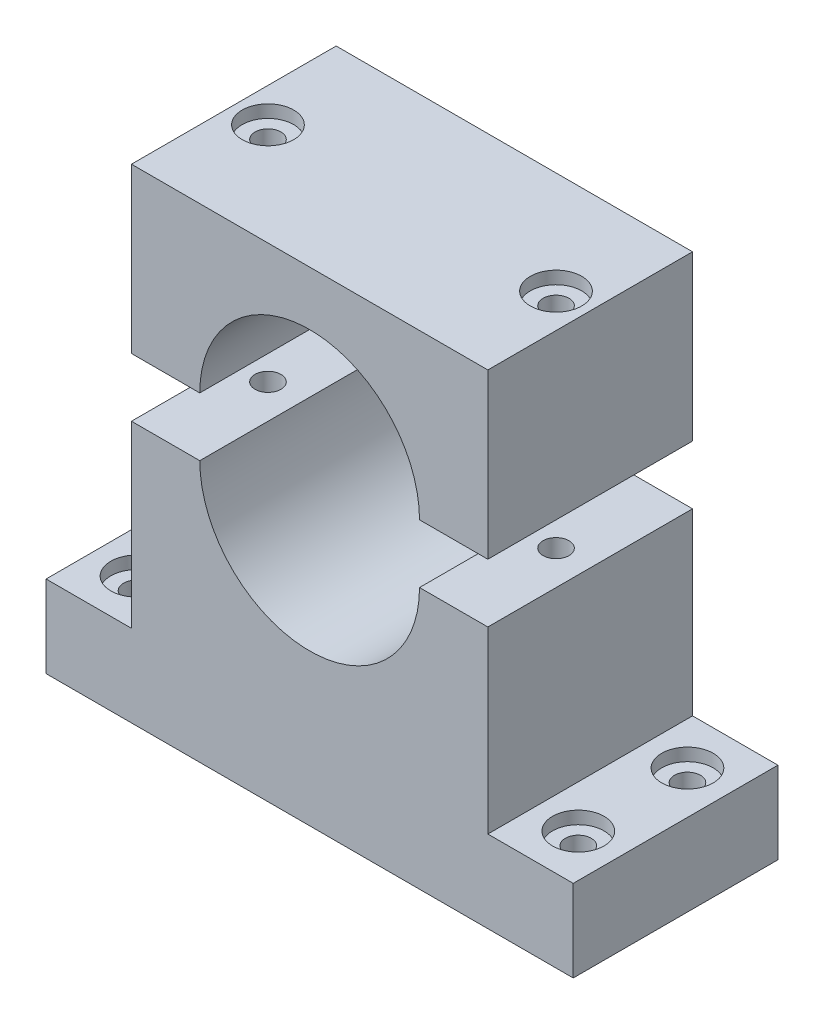
ISO-10303-21;
HEADER;
FILE_DESCRIPTION(('STEP AP214'),'2;1');
FILE_NAME('part.step','',(''),(''),'','','');
FILE_SCHEMA(('AUTOMOTIVE_DESIGN { 1 0 10303 214 1 1 1 1 }'));
ENDSEC;
DATA;
#1=APPLICATION_CONTEXT('core data for automotive mechanical design processes');
#2=APPLICATION_PROTOCOL_DEFINITION('international standard','automotive_design',2000,#1);
#3=PRODUCT_CONTEXT('',#1,'mechanical');
#4=PRODUCT('Part','Part','',(#3));
#5=PRODUCT_RELATED_PRODUCT_CATEGORY('part','',(#4));
#6=PRODUCT_DEFINITION_FORMATION('','',#4);
#7=PRODUCT_DEFINITION_CONTEXT('part definition',#1,'design');
#8=PRODUCT_DEFINITION('design','',#6,#7);
#9=PRODUCT_DEFINITION_SHAPE('','',#8);
#10=(LENGTH_UNIT() NAMED_UNIT(*) SI_UNIT(.MILLI.,.METRE.));
#11=(NAMED_UNIT(*) PLANE_ANGLE_UNIT() SI_UNIT($,.RADIAN.));
#12=(NAMED_UNIT(*) SI_UNIT($,.STERADIAN.) SOLID_ANGLE_UNIT());
#13=UNCERTAINTY_MEASURE_WITH_UNIT(LENGTH_MEASURE(1.E-05),#10,'distance_accuracy_value','');
#14=(GEOMETRIC_REPRESENTATION_CONTEXT(3) GLOBAL_UNCERTAINTY_ASSIGNED_CONTEXT((#13)) GLOBAL_UNIT_ASSIGNED_CONTEXT((#10,
#11,#12)) REPRESENTATION_CONTEXT('',''));
#15=CARTESIAN_POINT('',(0.,0.,0.));
#16=DIRECTION('',(0.,0.,1.));
#17=DIRECTION('',(1.,0.,0.));
#18=AXIS2_PLACEMENT_3D('',#15,#16,#17);
#19=CARTESIAN_POINT('',(16.1027237355266,8.59368157906341,30.));
#20=DIRECTION('',(0.,0.,-1.));
#21=DIRECTION('',(-1.,0.,0.));
#22=AXIS2_PLACEMENT_3D('',#19,#20,#21);
#23=CYLINDRICAL_SURFACE('',#22,16.1027237355266);
#24=CARTESIAN_POINT('',(16.1027237355266,8.59368157906341,0.));
#25=DIRECTION('',(0.,0.,-1.));
#26=DIRECTION('',(-1.,0.,0.));
#27=AXIS2_PLACEMENT_3D('',#24,#25,#26);
#28=CIRCLE('',#27,16.1027237355266);
#29=CARTESIAN_POINT('',(0.,8.59368157906341,0.));
#30=VERTEX_POINT('',#29);
#31=CARTESIAN_POINT('',(32.2054474710532,8.59368157906341,0.));
#32=VERTEX_POINT('',#31);
#33=EDGE_CURVE('E133',#30,#32,#28,.T.);
#34=ORIENTED_EDGE('',*,*,#33,.T.);
#35=DIRECTION('',(0.,0.,-1.));
#36=VECTOR('',#35,1.);
#37=CARTESIAN_POINT('',(32.2054474710532,8.59368157906341,30.));
#38=LINE('',#37,#36);
#39=CARTESIAN_POINT('',(32.2054474710532,8.59368157906341,30.));
#40=VERTEX_POINT('',#39);
#41=EDGE_CURVE('E12',#40,#32,#38,.T.);
#42=ORIENTED_EDGE('',*,*,#41,.F.);
#43=CARTESIAN_POINT('',(16.1027237355266,8.59368157906341,30.));
#44=DIRECTION('',(0.,0.,-1.));
#45=DIRECTION('',(-1.,0.,0.));
#46=AXIS2_PLACEMENT_3D('',#43,#44,#45);
#47=CIRCLE('',#46,16.1027237355266);
#48=CARTESIAN_POINT('',(0.,8.59368157906341,30.));
#49=VERTEX_POINT('',#48);
#50=EDGE_CURVE('E144',#49,#40,#47,.T.);
#51=ORIENTED_EDGE('',*,*,#50,.F.);
#52=DIRECTION('',(0.,0.,-1.));
#53=VECTOR('',#52,1.);
#54=CARTESIAN_POINT('',(0.,8.59368157906341,30.));
#55=LINE('',#54,#53);
#56=EDGE_CURVE('E129',#49,#30,#55,.T.);
#57=ORIENTED_EDGE('',*,*,#56,.T.);
#58=EDGE_LOOP('',(#34,#42,#51,#57));
#59=FACE_BOUND('',#58,.T.);
#60=ADVANCED_FACE('F47',(#59),#23,.F.);
#61=CARTESIAN_POINT('',(42.2175036796708,8.59368157906341,30.));
#62=DIRECTION('',(0.,1.,0.));
#63=DIRECTION('',(-1.,0.,0.));
#64=AXIS2_PLACEMENT_3D('',#61,#62,#63);
#65=PLANE('',#64);
#66=CARTESIAN_POINT('',(37.211475575362,8.59368157906341,15.));
#67=DIRECTION('',(0.,1.,0.));
#68=DIRECTION('',(-1.,0.,0.));
#69=AXIS2_PLACEMENT_3D('',#66,#67,#68);
#70=CIRCLE('',#69,1.89864999999999);
#71=CARTESIAN_POINT('',(35.312825575362,8.59368157906341,15.));
#72=VERTEX_POINT('',#71);
#73=EDGE_CURVE('E137',#72,#72,#70,.T.);
#74=ORIENTED_EDGE('',*,*,#73,.T.);
#75=EDGE_LOOP('',(#74));
#76=FACE_BOUND('',#75,.T.);
#77=DIRECTION('',(1.,0.,0.));
#78=VECTOR('',#77,1.);
#79=CARTESIAN_POINT('',(42.2175036796708,8.59368157906341,0.));
#80=LINE('',#79,#78);
#81=CARTESIAN_POINT('',(42.2175036796708,8.59368157906341,0.));
#82=VERTEX_POINT('',#81);
#83=EDGE_CURVE('E136',#32,#82,#80,.T.);
#84=ORIENTED_EDGE('',*,*,#83,.T.);
#85=DIRECTION('',(0.,0.,-1.));
#86=VECTOR('',#85,1.);
#87=CARTESIAN_POINT('',(42.2175036796708,8.59368157906341,30.));
#88=LINE('',#87,#86);
#89=CARTESIAN_POINT('',(42.2175036796708,8.59368157906341,30.));
#90=VERTEX_POINT('',#89);
#91=EDGE_CURVE('E56',#90,#82,#88,.T.);
#92=ORIENTED_EDGE('',*,*,#91,.F.);
#93=DIRECTION('',(1.,0.,0.));
#94=VECTOR('',#93,1.);
#95=CARTESIAN_POINT('',(42.2175036796708,8.59368157906341,30.));
#96=LINE('',#95,#94);
#97=EDGE_CURVE('E102',#40,#90,#96,.T.);
#98=ORIENTED_EDGE('',*,*,#97,.F.);
#99=ORIENTED_EDGE('',*,*,#41,.T.);
#100=EDGE_LOOP('',(#84,#92,#98,#99));
#101=FACE_BOUND('',#100,.T.);
#102=ADVANCED_FACE('F166',(#76,#101),#65,.F.);
#103=CARTESIAN_POINT('',(42.2175036796708,32.6226164797456,30.));
#104=DIRECTION('',(-1.,0.,0.));
#105=DIRECTION('',(0.,0.,1.));
#106=AXIS2_PLACEMENT_3D('',#103,#104,#105);
#107=PLANE('',#106);
#108=DIRECTION('',(0.,1.,0.));
#109=VECTOR('',#108,1.);
#110=CARTESIAN_POINT('',(42.2175036796708,32.6226164797456,0.));
#111=LINE('',#110,#109);
#112=CARTESIAN_POINT('',(42.2175036796708,32.6226164797456,0.));
#113=VERTEX_POINT('',#112);
#114=EDGE_CURVE('E139',#82,#113,#111,.T.);
#115=ORIENTED_EDGE('',*,*,#114,.T.);
#116=DIRECTION('',(0.,0.,-1.));
#117=VECTOR('',#116,1.);
#118=CARTESIAN_POINT('',(42.2175036796708,32.6226164797456,30.));
#119=LINE('',#118,#117);
#120=CARTESIAN_POINT('',(42.2175036796708,32.6226164797456,30.));
#121=VERTEX_POINT('',#120);
#122=EDGE_CURVE('E124',#121,#113,#119,.T.);
#123=ORIENTED_EDGE('',*,*,#122,.F.);
#124=DIRECTION('',(0.,1.,0.));
#125=VECTOR('',#124,1.);
#126=CARTESIAN_POINT('',(42.2175036796708,32.6226164797456,30.));
#127=LINE('',#126,#125);
#128=EDGE_CURVE('E115',#90,#121,#127,.T.);
#129=ORIENTED_EDGE('',*,*,#128,.F.);
#130=ORIENTED_EDGE('',*,*,#91,.T.);
#131=EDGE_LOOP('',(#115,#123,#129,#130));
#132=FACE_BOUND('',#131,.T.);
#133=ADVANCED_FACE('F169',(#132),#107,.F.);
#134=CARTESIAN_POINT('',(-10.0120562086176,32.6226164797456,30.));
#135=DIRECTION('',(0.,-1.,0.));
#136=DIRECTION('',(0.,0.,-1.));
#137=AXIS2_PLACEMENT_3D('',#134,#135,#136);
#138=PLANE('',#137);
#139=CARTESIAN_POINT('',(-5.00602810430879,32.6226164797456,15.));
#140=DIRECTION('',(0.,1.,0.));
#141=DIRECTION('',(0.,0.,1.));
#142=AXIS2_PLACEMENT_3D('',#139,#140,#141);
#143=CIRCLE('',#142,3.77063);
#144=CARTESIAN_POINT('',(-5.00602810430879,32.6226164797456,18.77063));
#145=VERTEX_POINT('',#144);
#146=EDGE_CURVE('E202',#145,#145,#143,.T.);
#147=ORIENTED_EDGE('',*,*,#146,.F.);
#148=EDGE_LOOP('',(#147));
#149=FACE_BOUND('',#148,.T.);
#150=CARTESIAN_POINT('',(37.211475575362,32.6226164797456,15.));
#151=DIRECTION('',(0.,1.,0.));
#152=DIRECTION('',(0.,0.,1.));
#153=AXIS2_PLACEMENT_3D('',#150,#151,#152);
#154=CIRCLE('',#153,3.77063);
#155=CARTESIAN_POINT('',(37.211475575362,32.6226164797456,18.77063));
#156=VERTEX_POINT('',#155);
#157=EDGE_CURVE('E159',#156,#156,#154,.T.);
#158=ORIENTED_EDGE('',*,*,#157,.F.);
#159=EDGE_LOOP('',(#158));
#160=FACE_BOUND('',#159,.T.);
#161=DIRECTION('',(-1.,0.,0.));
#162=VECTOR('',#161,1.);
#163=CARTESIAN_POINT('',(-10.0120562086176,32.6226164797456,0.));
#164=LINE('',#163,#162);
#165=CARTESIAN_POINT('',(-10.0120562086176,32.6226164797456,0.));
#166=VERTEX_POINT('',#165);
#167=EDGE_CURVE('E123',#113,#166,#164,.T.);
#168=ORIENTED_EDGE('',*,*,#167,.T.);
#169=DIRECTION('',(0.,0.,-1.));
#170=VECTOR('',#169,1.);
#171=CARTESIAN_POINT('',(-10.0120562086176,32.6226164797456,30.));
#172=LINE('',#171,#170);
#173=CARTESIAN_POINT('',(-10.0120562086176,32.6226164797456,30.));
#174=VERTEX_POINT('',#173);
#175=EDGE_CURVE('E120',#174,#166,#172,.T.);
#176=ORIENTED_EDGE('',*,*,#175,.F.);
#177=DIRECTION('',(-1.,0.,0.));
#178=VECTOR('',#177,1.);
#179=CARTESIAN_POINT('',(-10.0120562086176,32.6226164797456,30.));
#180=LINE('',#179,#178);
#181=EDGE_CURVE('E109',#121,#174,#180,.T.);
#182=ORIENTED_EDGE('',*,*,#181,.F.);
#183=ORIENTED_EDGE('',*,*,#122,.T.);
#184=EDGE_LOOP('',(#168,#176,#182,#183));
#185=FACE_BOUND('',#184,.T.);
#186=ADVANCED_FACE('F121',(#149,#160,#185),#138,.F.);
#187=CARTESIAN_POINT('',(-10.0120562086176,8.59368157906341,30.));
#188=DIRECTION('',(1.,0.,0.));
#189=DIRECTION('',(0.,0.,-1.));
#190=AXIS2_PLACEMENT_3D('',#187,#188,#189);
#191=PLANE('',#190);
#192=DIRECTION('',(0.,-1.,0.));
#193=VECTOR('',#192,1.);
#194=CARTESIAN_POINT('',(-10.0120562086176,8.59368157906341,0.));
#195=LINE('',#194,#193);
#196=CARTESIAN_POINT('',(-10.0120562086176,8.59368157906341,0.));
#197=VERTEX_POINT('',#196);
#198=EDGE_CURVE('E88',#166,#197,#195,.T.);
#199=ORIENTED_EDGE('',*,*,#198,.T.);
#200=DIRECTION('',(0.,0.,-1.));
#201=VECTOR('',#200,1.);
#202=CARTESIAN_POINT('',(-10.0120562086176,8.59368157906341,30.));
#203=LINE('',#202,#201);
#204=CARTESIAN_POINT('',(-10.0120562086176,8.59368157906341,30.));
#205=VERTEX_POINT('',#204);
#206=EDGE_CURVE('E125',#205,#197,#203,.T.);
#207=ORIENTED_EDGE('',*,*,#206,.F.);
#208=DIRECTION('',(0.,-1.,0.));
#209=VECTOR('',#208,1.);
#210=CARTESIAN_POINT('',(-10.0120562086176,8.59368157906341,30.));
#211=LINE('',#210,#209);
#212=EDGE_CURVE('E113',#174,#205,#211,.T.);
#213=ORIENTED_EDGE('',*,*,#212,.F.);
#214=ORIENTED_EDGE('',*,*,#175,.T.);
#215=EDGE_LOOP('',(#199,#207,#213,#214));
#216=FACE_BOUND('',#215,.T.);
#217=ADVANCED_FACE('F127',(#216),#191,.F.);
#218=CARTESIAN_POINT('',(0.,8.59368157906341,30.));
#219=DIRECTION('',(0.,1.,0.));
#220=DIRECTION('',(-1.,0.,0.));
#221=AXIS2_PLACEMENT_3D('',#218,#219,#220);
#222=PLANE('',#221);
#223=CARTESIAN_POINT('',(-5.00602810430879,8.59368157906341,15.));
#224=DIRECTION('',(0.,1.,0.));
#225=DIRECTION('',(-1.,0.,0.));
#226=AXIS2_PLACEMENT_3D('',#223,#224,#225);
#227=CIRCLE('',#226,1.89865);
#228=CARTESIAN_POINT('',(-6.90467810430879,8.59368157906341,15.));
#229=VERTEX_POINT('',#228);
#230=EDGE_CURVE('E50',#229,#229,#227,.T.);
#231=ORIENTED_EDGE('',*,*,#230,.T.);
#232=EDGE_LOOP('',(#231));
#233=FACE_BOUND('',#232,.T.);
#234=DIRECTION('',(1.,0.,0.));
#235=VECTOR('',#234,1.);
#236=CARTESIAN_POINT('',(0.,8.59368157906341,0.));
#237=LINE('',#236,#235);
#238=EDGE_CURVE('E94',#197,#30,#237,.T.);
#239=ORIENTED_EDGE('',*,*,#238,.T.);
#240=ORIENTED_EDGE('',*,*,#56,.F.);
#241=DIRECTION('',(1.,0.,0.));
#242=VECTOR('',#241,1.);
#243=CARTESIAN_POINT('',(0.,8.59368157906341,30.));
#244=LINE('',#243,#242);
#245=EDGE_CURVE('E65',#205,#49,#244,.T.);
#246=ORIENTED_EDGE('',*,*,#245,.F.);
#247=ORIENTED_EDGE('',*,*,#206,.T.);
#248=EDGE_LOOP('',(#239,#240,#246,#247));
#249=FACE_BOUND('',#248,.T.);
#250=ADVANCED_FACE('F174',(#233,#249),#222,.F.);
#251=CARTESIAN_POINT('',(16.1027237355266,8.59368157906341,30.));
#252=DIRECTION('',(0.,0.,-1.));
#253=DIRECTION('',(-1.,0.,0.));
#254=AXIS2_PLACEMENT_3D('',#251,#252,#253);
#255=PLANE('',#254);
#256=ORIENTED_EDGE('',*,*,#50,.T.);
#257=ORIENTED_EDGE('',*,*,#97,.T.);
#258=ORIENTED_EDGE('',*,*,#128,.T.);
#259=ORIENTED_EDGE('',*,*,#181,.T.);
#260=ORIENTED_EDGE('',*,*,#212,.T.);
#261=ORIENTED_EDGE('',*,*,#245,.T.);
#262=EDGE_LOOP('',(#256,#257,#258,#259,#260,#261));
#263=FACE_BOUND('',#262,.T.);
#264=ADVANCED_FACE('F111',(#263),#255,.F.);
#265=CARTESIAN_POINT('',(16.1027237355266,8.59368157906341,0.));
#266=DIRECTION('',(0.,0.,-1.));
#267=DIRECTION('',(-1.,0.,0.));
#268=AXIS2_PLACEMENT_3D('',#265,#266,#267);
#269=PLANE('',#268);
#270=ORIENTED_EDGE('',*,*,#33,.F.);
#271=ORIENTED_EDGE('',*,*,#238,.F.);
#272=ORIENTED_EDGE('',*,*,#198,.F.);
#273=ORIENTED_EDGE('',*,*,#167,.F.);
#274=ORIENTED_EDGE('',*,*,#114,.F.);
#275=ORIENTED_EDGE('',*,*,#83,.F.);
#276=EDGE_LOOP('',(#270,#271,#272,#273,#274,#275));
#277=FACE_BOUND('',#276,.T.);
#278=ADVANCED_FACE('F172',(#277),#269,.T.);
#279=CARTESIAN_POINT('',(37.211475575362,32.6226164797456,15.));
#280=DIRECTION('',(0.,1.,0.));
#281=DIRECTION('',(0.,0.,1.));
#282=AXIS2_PLACEMENT_3D('',#279,#280,#281);
#283=CYLINDRICAL_SURFACE('',#282,1.89864999999999);
#284=CARTESIAN_POINT('',(37.211475575362,30.7684164797456,15.));
#285=DIRECTION('',(0.,1.,0.));
#286=DIRECTION('',(0.,0.,1.));
#287=AXIS2_PLACEMENT_3D('',#284,#285,#286);
#288=CIRCLE('',#287,1.89865000000001);
#289=CARTESIAN_POINT('',(37.211475575362,30.7684164797456,16.89865));
#290=VERTEX_POINT('',#289);
#291=EDGE_CURVE('E150',#290,#290,#288,.T.);
#292=ORIENTED_EDGE('',*,*,#291,.T.);
#293=EDGE_LOOP('',(#292));
#294=FACE_BOUND('',#293,.T.);
#295=ORIENTED_EDGE('',*,*,#73,.F.);
#296=EDGE_LOOP('',(#295));
#297=FACE_BOUND('',#296,.T.);
#298=ADVANCED_FACE('F237',(#294,#297),#283,.F.);
#299=CARTESIAN_POINT('',(39.110125575362,30.7684164797456,15.));
#300=DIRECTION('',(0.,-1.,0.));
#301=DIRECTION('',(0.,0.,-1.));
#302=AXIS2_PLACEMENT_3D('',#299,#300,#301);
#303=PLANE('',#302);
#304=ORIENTED_EDGE('',*,*,#291,.F.);
#305=EDGE_LOOP('',(#304));
#306=FACE_BOUND('',#305,.T.);
#307=CARTESIAN_POINT('',(37.211475575362,30.7684164797456,15.));
#308=DIRECTION('',(0.,1.,0.));
#309=DIRECTION('',(0.,0.,1.));
#310=AXIS2_PLACEMENT_3D('',#307,#308,#309);
#311=CIRCLE('',#310,3.77063);
#312=CARTESIAN_POINT('',(37.211475575362,30.7684164797456,18.77063));
#313=VERTEX_POINT('',#312);
#314=EDGE_CURVE('E154',#313,#313,#311,.T.);
#315=ORIENTED_EDGE('',*,*,#314,.T.);
#316=EDGE_LOOP('',(#315));
#317=FACE_BOUND('',#316,.T.);
#318=ADVANCED_FACE('F233',(#306,#317),#303,.F.);
#319=CARTESIAN_POINT('',(37.211475575362,32.6226164797456,15.));
#320=DIRECTION('',(0.,1.,0.));
#321=DIRECTION('',(0.,0.,1.));
#322=AXIS2_PLACEMENT_3D('',#319,#320,#321);
#323=CYLINDRICAL_SURFACE('',#322,3.77063);
#324=ORIENTED_EDGE('',*,*,#314,.F.);
#325=EDGE_LOOP('',(#324));
#326=FACE_BOUND('',#325,.T.);
#327=ORIENTED_EDGE('',*,*,#157,.T.);
#328=EDGE_LOOP('',(#327));
#329=FACE_BOUND('',#328,.T.);
#330=ADVANCED_FACE('F229',(#326,#329),#323,.F.);
#331=CARTESIAN_POINT('',(-5.00602810430879,32.6226164797456,15.));
#332=DIRECTION('',(0.,1.,0.));
#333=DIRECTION('',(0.,0.,1.));
#334=AXIS2_PLACEMENT_3D('',#331,#332,#333);
#335=CYLINDRICAL_SURFACE('',#334,1.89865);
#336=CARTESIAN_POINT('',(-5.00602810430879,30.7684164797456,15.));
#337=DIRECTION('',(0.,1.,0.));
#338=DIRECTION('',(0.,0.,1.));
#339=AXIS2_PLACEMENT_3D('',#336,#337,#338);
#340=CIRCLE('',#339,1.89865000000001);
#341=CARTESIAN_POINT('',(-5.00602810430879,30.7684164797456,16.89865));
#342=VERTEX_POINT('',#341);
#343=EDGE_CURVE('E206',#342,#342,#340,.T.);
#344=ORIENTED_EDGE('',*,*,#343,.T.);
#345=EDGE_LOOP('',(#344));
#346=FACE_BOUND('',#345,.T.);
#347=ORIENTED_EDGE('',*,*,#230,.F.);
#348=EDGE_LOOP('',(#347));
#349=FACE_BOUND('',#348,.T.);
#350=ADVANCED_FACE('F222',(#346,#349),#335,.F.);
#351=CARTESIAN_POINT('',(-3.10737810430879,30.7684164797456,15.));
#352=DIRECTION('',(0.,-1.,0.));
#353=DIRECTION('',(0.,0.,-1.));
#354=AXIS2_PLACEMENT_3D('',#351,#352,#353);
#355=PLANE('',#354);
#356=ORIENTED_EDGE('',*,*,#343,.F.);
#357=EDGE_LOOP('',(#356));
#358=FACE_BOUND('',#357,.T.);
#359=CARTESIAN_POINT('',(-5.00602810430879,30.7684164797456,15.));
#360=DIRECTION('',(0.,1.,0.));
#361=DIRECTION('',(0.,0.,1.));
#362=AXIS2_PLACEMENT_3D('',#359,#360,#361);
#363=CIRCLE('',#362,3.77063);
#364=CARTESIAN_POINT('',(-5.00602810430879,30.7684164797456,18.77063));
#365=VERTEX_POINT('',#364);
#366=EDGE_CURVE('E210',#365,#365,#363,.T.);
#367=ORIENTED_EDGE('',*,*,#366,.T.);
#368=EDGE_LOOP('',(#367));
#369=FACE_BOUND('',#368,.T.);
#370=ADVANCED_FACE('F216',(#358,#369),#355,.F.);
#371=CARTESIAN_POINT('',(-5.00602810430879,32.6226164797456,15.));
#372=DIRECTION('',(0.,1.,0.));
#373=DIRECTION('',(0.,0.,1.));
#374=AXIS2_PLACEMENT_3D('',#371,#372,#373);
#375=CYLINDRICAL_SURFACE('',#374,3.77063);
#376=ORIENTED_EDGE('',*,*,#366,.F.);
#377=EDGE_LOOP('',(#376));
#378=FACE_BOUND('',#377,.T.);
#379=ORIENTED_EDGE('',*,*,#146,.T.);
#380=EDGE_LOOP('',(#379));
#381=FACE_BOUND('',#380,.T.);
#382=ADVANCED_FACE('F214',(#378,#381),#375,.F.);
#383=CLOSED_SHELL('',(#60,#102,#133,#186,#217,#250,#264,#278,#298,#318,#330,#350,#370,#382));
#384=MANIFOLD_SOLID_BREP('B2',#383);
#385=CARTESIAN_POINT('',(16.1027237355266,0.,30.));
#386=DIRECTION('',(0.,0.,-1.));
#387=DIRECTION('',(-1.,0.,0.));
#388=AXIS2_PLACEMENT_3D('',#385,#386,#387);
#389=CYLINDRICAL_SURFACE('',#388,16.1027237355266);
#390=CARTESIAN_POINT('',(16.1027237355266,0.,0.));
#391=DIRECTION('',(0.,0.,-1.));
#392=DIRECTION('',(1.,0.,0.));
#393=AXIS2_PLACEMENT_3D('',#390,#391,#392);
#394=CIRCLE('',#393,16.1027237355266);
#395=CARTESIAN_POINT('',(32.2054474710532,0.,0.));
#396=VERTEX_POINT('',#395);
#397=CARTESIAN_POINT('',(0.,0.,0.));
#398=VERTEX_POINT('',#397);
#399=EDGE_CURVE('E435',#396,#398,#394,.T.);
#400=ORIENTED_EDGE('',*,*,#399,.T.);
#401=DIRECTION('',(0.,0.,-1.));
#402=VECTOR('',#401,1.);
#403=CARTESIAN_POINT('',(0.,0.,30.));
#404=LINE('',#403,#402);
#405=CARTESIAN_POINT('',(0.,0.,30.));
#406=VERTEX_POINT('',#405);
#407=EDGE_CURVE('E45',#406,#398,#404,.T.);
#408=ORIENTED_EDGE('',*,*,#407,.F.);
#409=CARTESIAN_POINT('',(16.1027237355266,0.,30.));
#410=DIRECTION('',(0.,0.,-1.));
#411=DIRECTION('',(1.,0.,0.));
#412=AXIS2_PLACEMENT_3D('',#409,#410,#411);
#413=CIRCLE('',#412,16.1027237355266);
#414=CARTESIAN_POINT('',(32.2054474710532,0.,30.));
#415=VERTEX_POINT('',#414);
#416=EDGE_CURVE('E454',#415,#406,#413,.T.);
#417=ORIENTED_EDGE('',*,*,#416,.F.);
#418=DIRECTION('',(0.,0.,-1.));
#419=VECTOR('',#418,1.);
#420=CARTESIAN_POINT('',(32.2054474710532,0.,30.));
#421=LINE('',#420,#419);
#422=EDGE_CURVE('E431',#415,#396,#421,.T.);
#423=ORIENTED_EDGE('',*,*,#422,.T.);
#424=EDGE_LOOP('',(#400,#408,#417,#423));
#425=FACE_BOUND('',#424,.T.);
#426=ADVANCED_FACE('F325',(#425),#389,.F.);
#427=CARTESIAN_POINT('',(0.,0.,30.));
#428=DIRECTION('',(0.,-1.,0.));
#429=DIRECTION('',(1.,0.,0.));
#430=AXIS2_PLACEMENT_3D('',#427,#428,#429);
#431=PLANE('',#430);
#432=CARTESIAN_POINT('',(-5.00602810430879,0.,15.));
#433=DIRECTION('',(0.,-1.,0.));
#434=DIRECTION('',(1.,0.,0.));
#435=AXIS2_PLACEMENT_3D('',#432,#433,#434);
#436=CIRCLE('',#435,1.89865);
#437=CARTESIAN_POINT('',(-3.1073781043088,0.,15.));
#438=VERTEX_POINT('',#437);
#439=EDGE_CURVE('E505',#438,#438,#436,.T.);
#440=ORIENTED_EDGE('',*,*,#439,.T.);
#441=EDGE_LOOP('',(#440));
#442=FACE_BOUND('',#441,.T.);
#443=DIRECTION('',(-1.,0.,0.));
#444=VECTOR('',#443,1.);
#445=CARTESIAN_POINT('',(0.,0.,0.));
#446=LINE('',#445,#444);
#447=CARTESIAN_POINT('',(-10.0120562086176,0.,0.));
#448=VERTEX_POINT('',#447);
#449=EDGE_CURVE('E439',#398,#448,#446,.T.);
#450=ORIENTED_EDGE('',*,*,#449,.T.);
#451=DIRECTION('',(0.,0.,-1.));
#452=VECTOR('',#451,1.);
#453=CARTESIAN_POINT('',(-10.0120562086176,0.,30.));
#454=LINE('',#453,#452);
#455=CARTESIAN_POINT('',(-10.0120562086176,0.,30.));
#456=VERTEX_POINT('',#455);
#457=EDGE_CURVE('E335',#456,#448,#454,.T.);
#458=ORIENTED_EDGE('',*,*,#457,.F.);
#459=DIRECTION('',(-1.,0.,0.));
#460=VECTOR('',#459,1.);
#461=CARTESIAN_POINT('',(0.,0.,30.));
#462=LINE('',#461,#460);
#463=EDGE_CURVE('E392',#406,#456,#462,.T.);
#464=ORIENTED_EDGE('',*,*,#463,.F.);
#465=ORIENTED_EDGE('',*,*,#407,.T.);
#466=EDGE_LOOP('',(#450,#458,#464,#465));
#467=FACE_BOUND('',#466,.T.);
#468=ADVANCED_FACE('F585',(#442,#467),#431,.F.);
#469=CARTESIAN_POINT('',(-10.0120562086176,0.,30.));
#470=DIRECTION('',(1.,0.,0.));
#471=DIRECTION('',(0.,0.,-1.));
#472=AXIS2_PLACEMENT_3D('',#469,#470,#471);
#473=PLANE('',#472);
#474=DIRECTION('',(0.,-1.,0.));
#475=VECTOR('',#474,1.);
#476=CARTESIAN_POINT('',(-10.0120562086176,0.,0.));
#477=LINE('',#476,#475);
#478=CARTESIAN_POINT('',(-10.0120562086176,-26.2816475476211,0.));
#479=VERTEX_POINT('',#478);
#480=EDGE_CURVE('E441',#448,#479,#477,.T.);
#481=ORIENTED_EDGE('',*,*,#480,.T.);
#482=DIRECTION('',(0.,0.,-1.));
#483=VECTOR('',#482,1.);
#484=CARTESIAN_POINT('',(-10.0120562086176,-26.2816475476211,30.));
#485=LINE('',#484,#483);
#486=CARTESIAN_POINT('',(-10.0120562086176,-26.2816475476211,30.));
#487=VERTEX_POINT('',#486);
#488=EDGE_CURVE('E467',#487,#479,#485,.T.);
#489=ORIENTED_EDGE('',*,*,#488,.F.);
#490=DIRECTION('',(0.,-1.,0.));
#491=VECTOR('',#490,1.);
#492=CARTESIAN_POINT('',(-10.0120562086176,0.,30.));
#493=LINE('',#492,#491);
#494=EDGE_CURVE('E476',#456,#487,#493,.T.);
#495=ORIENTED_EDGE('',*,*,#494,.F.);
#496=ORIENTED_EDGE('',*,*,#457,.T.);
#497=EDGE_LOOP('',(#481,#489,#495,#496));
#498=FACE_BOUND('',#497,.T.);
#499=ADVANCED_FACE('F474',(#498),#473,.F.);
#500=CARTESIAN_POINT('',(-10.0120562086176,-26.2816475476211,30.));
#501=DIRECTION('',(0.,-1.,0.));
#502=DIRECTION('',(0.,0.,-1.));
#503=AXIS2_PLACEMENT_3D('',#500,#501,#502);
#504=PLANE('',#503);
#505=CARTESIAN_POINT('',(-16.2695913390036,-26.2816475476211,7.));
#506=DIRECTION('',(0.,1.,0.));
#507=DIRECTION('',(0.,0.,1.));
#508=AXIS2_PLACEMENT_3D('',#505,#506,#507);
#509=CIRCLE('',#508,3.77062999999999);
#510=CARTESIAN_POINT('',(-16.2695913390036,-26.2816475476211,10.77063));
#511=VERTEX_POINT('',#510);
#512=EDGE_CURVE('E556',#511,#511,#509,.T.);
#513=ORIENTED_EDGE('',*,*,#512,.F.);
#514=EDGE_LOOP('',(#513));
#515=FACE_BOUND('',#514,.T.);
#516=CARTESIAN_POINT('',(-16.2695913390036,-26.2816475476211,23.));
#517=DIRECTION('',(0.,1.,0.));
#518=DIRECTION('',(0.,0.,1.));
#519=AXIS2_PLACEMENT_3D('',#516,#517,#518);
#520=CIRCLE('',#519,3.77062999999999);
#521=CARTESIAN_POINT('',(-16.2695913390036,-26.2816475476211,26.77063));
#522=VERTEX_POINT('',#521);
#523=EDGE_CURVE('E544',#522,#522,#520,.T.);
#524=ORIENTED_EDGE('',*,*,#523,.F.);
#525=EDGE_LOOP('',(#524));
#526=FACE_BOUND('',#525,.T.);
#527=DIRECTION('',(-1.,0.,0.));
#528=VECTOR('',#527,1.);
#529=CARTESIAN_POINT('',(-10.0120562086176,-26.2816475476211,0.));
#530=LINE('',#529,#528);
#531=CARTESIAN_POINT('',(-22.5271264693895,-26.2816475476211,0.));
#532=VERTEX_POINT('',#531);
#533=EDGE_CURVE('E443',#479,#532,#530,.T.);
#534=ORIENTED_EDGE('',*,*,#533,.T.);
#535=DIRECTION('',(0.,0.,-1.));
#536=VECTOR('',#535,1.);
#537=CARTESIAN_POINT('',(-22.5271264693895,-26.2816475476211,30.));
#538=LINE('',#537,#536);
#539=CARTESIAN_POINT('',(-22.5271264693895,-26.2816475476211,30.));
#540=VERTEX_POINT('',#539);
#541=EDGE_CURVE('E464',#540,#532,#538,.T.);
#542=ORIENTED_EDGE('',*,*,#541,.F.);
#543=DIRECTION('',(-1.,0.,0.));
#544=VECTOR('',#543,1.);
#545=CARTESIAN_POINT('',(-10.0120562086176,-26.2816475476211,30.));
#546=LINE('',#545,#544);
#547=EDGE_CURVE('E494',#487,#540,#546,.T.);
#548=ORIENTED_EDGE('',*,*,#547,.F.);
#549=ORIENTED_EDGE('',*,*,#488,.T.);
#550=EDGE_LOOP('',(#534,#542,#548,#549));
#551=FACE_BOUND('',#550,.T.);
#552=ADVANCED_FACE('F485',(#515,#526,#551),#504,.F.);
#553=CARTESIAN_POINT('',(-22.5271264693895,-26.2816475476211,30.));
#554=DIRECTION('',(1.,0.,0.));
#555=DIRECTION('',(0.,0.,-1.));
#556=AXIS2_PLACEMENT_3D('',#553,#554,#555);
#557=PLANE('',#556);
#558=DIRECTION('',(0.,-1.,0.));
#559=VECTOR('',#558,1.);
#560=CARTESIAN_POINT('',(-22.5271264693895,-26.2816475476211,0.));
#561=LINE('',#560,#559);
#562=CARTESIAN_POINT('',(-22.5271264693895,-38.2961149979622,0.));
#563=VERTEX_POINT('',#562);
#564=EDGE_CURVE('E445',#532,#563,#561,.T.);
#565=ORIENTED_EDGE('',*,*,#564,.T.);
#566=DIRECTION('',(0.,0.,-1.));
#567=VECTOR('',#566,1.);
#568=CARTESIAN_POINT('',(-22.5271264693895,-38.2961149979622,30.));
#569=LINE('',#568,#567);
#570=CARTESIAN_POINT('',(-22.5271264693895,-38.2961149979622,30.));
#571=VERTEX_POINT('',#570);
#572=EDGE_CURVE('E461',#571,#563,#569,.T.);
#573=ORIENTED_EDGE('',*,*,#572,.F.);
#574=DIRECTION('',(0.,-1.,0.));
#575=VECTOR('',#574,1.);
#576=CARTESIAN_POINT('',(-22.5271264693895,-26.2816475476211,30.));
#577=LINE('',#576,#575);
#578=EDGE_CURVE('E491',#540,#571,#577,.T.);
#579=ORIENTED_EDGE('',*,*,#578,.F.);
#580=ORIENTED_EDGE('',*,*,#541,.T.);
#581=EDGE_LOOP('',(#565,#573,#579,#580));
#582=FACE_BOUND('',#581,.T.);
#583=ADVANCED_FACE('F489',(#582),#557,.F.);
#584=CARTESIAN_POINT('',(-22.5271264693895,-38.2961149979622,30.));
#585=DIRECTION('',(0.,1.,0.));
#586=DIRECTION('',(0.,0.,1.));
#587=AXIS2_PLACEMENT_3D('',#584,#585,#586);
#588=PLANE('',#587);
#589=CARTESIAN_POINT('',(-16.2695913390036,-38.2961149979622,7.));
#590=DIRECTION('',(0.,1.,0.));
#591=DIRECTION('',(0.,0.,1.));
#592=AXIS2_PLACEMENT_3D('',#589,#590,#591);
#593=CIRCLE('',#592,1.89865);
#594=CARTESIAN_POINT('',(-16.2695913390036,-38.2961149979622,8.89865));
#595=VERTEX_POINT('',#594);
#596=EDGE_CURVE('E547',#595,#595,#593,.T.);
#597=ORIENTED_EDGE('',*,*,#596,.T.);
#598=EDGE_LOOP('',(#597));
#599=FACE_BOUND('',#598,.T.);
#600=CARTESIAN_POINT('',(-16.2695913390036,-38.2961149979622,23.));
#601=DIRECTION('',(0.,1.,0.));
#602=DIRECTION('',(0.,0.,1.));
#603=AXIS2_PLACEMENT_3D('',#600,#601,#602);
#604=CIRCLE('',#603,1.89865);
#605=CARTESIAN_POINT('',(-16.2695913390036,-38.2961149979622,24.89865));
#606=VERTEX_POINT('',#605);
#607=EDGE_CURVE('E535',#606,#606,#604,.T.);
#608=ORIENTED_EDGE('',*,*,#607,.T.);
#609=EDGE_LOOP('',(#608));
#610=FACE_BOUND('',#609,.T.);
#611=CARTESIAN_POINT('',(48.4750388100567,-38.2961149979622,23.));
#612=DIRECTION('',(0.,1.,0.));
#613=DIRECTION('',(0.,0.,1.));
#614=AXIS2_PLACEMENT_3D('',#611,#612,#613);
#615=CIRCLE('',#614,1.89864999999999);
#616=CARTESIAN_POINT('',(48.4750388100567,-38.2961149979622,24.89865));
#617=VERTEX_POINT('',#616);
#618=EDGE_CURVE('E523',#617,#617,#615,.T.);
#619=ORIENTED_EDGE('',*,*,#618,.T.);
#620=EDGE_LOOP('',(#619));
#621=FACE_BOUND('',#620,.T.);
#622=CARTESIAN_POINT('',(48.4750388100568,-38.2961149979622,7.));
#623=DIRECTION('',(0.,1.,0.));
#624=DIRECTION('',(0.,0.,1.));
#625=AXIS2_PLACEMENT_3D('',#622,#623,#624);
#626=CIRCLE('',#625,1.89864999999999);
#627=CARTESIAN_POINT('',(48.4750388100568,-38.2961149979622,8.89865));
#628=VERTEX_POINT('',#627);
#629=EDGE_CURVE('E511',#628,#628,#626,.T.);
#630=ORIENTED_EDGE('',*,*,#629,.T.);
#631=EDGE_LOOP('',(#630));
#632=FACE_BOUND('',#631,.T.);
#633=CARTESIAN_POINT('',(-5.00602810430879,-38.2961149979622,15.));
#634=DIRECTION('',(0.,1.,0.));
#635=DIRECTION('',(0.,0.,1.));
#636=AXIS2_PLACEMENT_3D('',#633,#634,#635);
#637=CIRCLE('',#636,1.89864999999998);
#638=CARTESIAN_POINT('',(-5.00602810430879,-38.2961149979622,16.89865));
#639=VERTEX_POINT('',#638);
#640=EDGE_CURVE('E508',#639,#639,#637,.T.);
#641=ORIENTED_EDGE('',*,*,#640,.T.);
#642=EDGE_LOOP('',(#641));
#643=FACE_BOUND('',#642,.T.);
#644=CARTESIAN_POINT('',(37.211475575362,-38.2961149979622,15.));
#645=DIRECTION('',(0.,1.,0.));
#646=DIRECTION('',(0.,0.,1.));
#647=AXIS2_PLACEMENT_3D('',#644,#645,#646);
#648=CIRCLE('',#647,1.89864999999998);
#649=CARTESIAN_POINT('',(37.211475575362,-38.2961149979622,16.89865));
#650=VERTEX_POINT('',#649);
#651=EDGE_CURVE('E502',#650,#650,#648,.T.);
#652=ORIENTED_EDGE('',*,*,#651,.T.);
#653=EDGE_LOOP('',(#652));
#654=FACE_BOUND('',#653,.T.);
#655=DIRECTION('',(1.,0.,0.));
#656=VECTOR('',#655,1.);
#657=CARTESIAN_POINT('',(-22.5271264693895,-38.2961149979622,0.));
#658=LINE('',#657,#656);
#659=CARTESIAN_POINT('',(54.7325739404427,-38.2961149979622,0.));
#660=VERTEX_POINT('',#659);
#661=EDGE_CURVE('E447',#563,#660,#658,.T.);
#662=ORIENTED_EDGE('',*,*,#661,.T.);
#663=DIRECTION('',(0.,0.,-1.));
#664=VECTOR('',#663,1.);
#665=CARTESIAN_POINT('',(54.7325739404427,-38.2961149979622,30.));
#666=LINE('',#665,#664);
#667=CARTESIAN_POINT('',(54.7325739404427,-38.2961149979622,30.));
#668=VERTEX_POINT('',#667);
#669=EDGE_CURVE('E458',#668,#660,#666,.T.);
#670=ORIENTED_EDGE('',*,*,#669,.F.);
#671=DIRECTION('',(1.,0.,0.));
#672=VECTOR('',#671,1.);
#673=CARTESIAN_POINT('',(-22.5271264693895,-38.2961149979622,30.));
#674=LINE('',#673,#672);
#675=EDGE_CURVE('E493',#571,#668,#674,.T.);
#676=ORIENTED_EDGE('',*,*,#675,.F.);
#677=ORIENTED_EDGE('',*,*,#572,.T.);
#678=EDGE_LOOP('',(#662,#670,#676,#677));
#679=FACE_BOUND('',#678,.T.);
#680=ADVANCED_FACE('F598',(#599,#610,#621,#632,#643,#654,#679),#588,.F.);
#681=CARTESIAN_POINT('',(54.7325739404427,-26.2816475476211,30.));
#682=DIRECTION('',(-1.,0.,0.));
#683=DIRECTION('',(0.,0.,1.));
#684=AXIS2_PLACEMENT_3D('',#681,#682,#683);
#685=PLANE('',#684);
#686=DIRECTION('',(0.,1.,0.));
#687=VECTOR('',#686,1.);
#688=CARTESIAN_POINT('',(54.7325739404427,-26.2816475476211,0.));
#689=LINE('',#688,#687);
#690=CARTESIAN_POINT('',(54.7325739404427,-26.2816475476211,0.));
#691=VERTEX_POINT('',#690);
#692=EDGE_CURVE('E449',#660,#691,#689,.T.);
#693=ORIENTED_EDGE('',*,*,#692,.T.);
#694=DIRECTION('',(0.,0.,-1.));
#695=VECTOR('',#694,1.);
#696=CARTESIAN_POINT('',(54.7325739404427,-26.2816475476211,30.));
#697=LINE('',#696,#695);
#698=CARTESIAN_POINT('',(54.7325739404427,-26.2816475476211,30.));
#699=VERTEX_POINT('',#698);
#700=EDGE_CURVE('E426',#699,#691,#697,.T.);
#701=ORIENTED_EDGE('',*,*,#700,.F.);
#702=DIRECTION('',(0.,1.,0.));
#703=VECTOR('',#702,1.);
#704=CARTESIAN_POINT('',(54.7325739404427,-26.2816475476211,30.));
#705=LINE('',#704,#703);
#706=EDGE_CURVE('E417',#668,#699,#705,.T.);
#707=ORIENTED_EDGE('',*,*,#706,.F.);
#708=ORIENTED_EDGE('',*,*,#669,.T.);
#709=EDGE_LOOP('',(#693,#701,#707,#708));
#710=FACE_BOUND('',#709,.T.);
#711=ADVANCED_FACE('F595',(#710),#685,.F.);
#712=CARTESIAN_POINT('',(42.2175036796708,-26.2816475476211,30.));
#713=DIRECTION('',(0.,-1.,0.));
#714=DIRECTION('',(0.,0.,-1.));
#715=AXIS2_PLACEMENT_3D('',#712,#713,#714);
#716=PLANE('',#715);
#717=CARTESIAN_POINT('',(48.4750388100567,-26.2816475476211,23.));
#718=DIRECTION('',(0.,1.,0.));
#719=DIRECTION('',(0.,0.,1.));
#720=AXIS2_PLACEMENT_3D('',#717,#718,#719);
#721=CIRCLE('',#720,3.77063);
#722=CARTESIAN_POINT('',(48.4750388100567,-26.2816475476211,26.77063));
#723=VERTEX_POINT('',#722);
#724=EDGE_CURVE('E532',#723,#723,#721,.T.);
#725=ORIENTED_EDGE('',*,*,#724,.F.);
#726=EDGE_LOOP('',(#725));
#727=FACE_BOUND('',#726,.T.);
#728=CARTESIAN_POINT('',(48.4750388100568,-26.2816475476211,7.));
#729=DIRECTION('',(0.,1.,0.));
#730=DIRECTION('',(0.,0.,1.));
#731=AXIS2_PLACEMENT_3D('',#728,#729,#730);
#732=CIRCLE('',#731,3.77063);
#733=CARTESIAN_POINT('',(48.4750388100568,-26.2816475476211,10.77063));
#734=VERTEX_POINT('',#733);
#735=EDGE_CURVE('E520',#734,#734,#732,.T.);
#736=ORIENTED_EDGE('',*,*,#735,.F.);
#737=EDGE_LOOP('',(#736));
#738=FACE_BOUND('',#737,.T.);
#739=DIRECTION('',(-1.,0.,0.));
#740=VECTOR('',#739,1.);
#741=CARTESIAN_POINT('',(42.2175036796708,-26.2816475476211,0.));
#742=LINE('',#741,#740);
#743=CARTESIAN_POINT('',(42.2175036796708,-26.2816475476211,0.));
#744=VERTEX_POINT('',#743);
#745=EDGE_CURVE('E425',#691,#744,#742,.T.);
#746=ORIENTED_EDGE('',*,*,#745,.T.);
#747=DIRECTION('',(0.,0.,-1.));
#748=VECTOR('',#747,1.);
#749=CARTESIAN_POINT('',(42.2175036796708,-26.2816475476211,30.));
#750=LINE('',#749,#748);
#751=CARTESIAN_POINT('',(42.2175036796708,-26.2816475476211,30.));
#752=VERTEX_POINT('',#751);
#753=EDGE_CURVE('E422',#752,#744,#750,.T.);
#754=ORIENTED_EDGE('',*,*,#753,.F.);
#755=DIRECTION('',(-1.,0.,0.));
#756=VECTOR('',#755,1.);
#757=CARTESIAN_POINT('',(42.2175036796708,-26.2816475476211,30.));
#758=LINE('',#757,#756);
#759=EDGE_CURVE('E411',#699,#752,#758,.T.);
#760=ORIENTED_EDGE('',*,*,#759,.F.);
#761=ORIENTED_EDGE('',*,*,#700,.T.);
#762=EDGE_LOOP('',(#746,#754,#760,#761));
#763=FACE_BOUND('',#762,.T.);
#764=ADVANCED_FACE('F423',(#727,#738,#763),#716,.F.);
#765=CARTESIAN_POINT('',(42.2175036796708,0.,30.));
#766=DIRECTION('',(-1.,0.,0.));
#767=DIRECTION('',(0.,0.,1.));
#768=AXIS2_PLACEMENT_3D('',#765,#766,#767);
#769=PLANE('',#768);
#770=DIRECTION('',(0.,1.,0.));
#771=VECTOR('',#770,1.);
#772=CARTESIAN_POINT('',(42.2175036796708,0.,0.));
#773=LINE('',#772,#771);
#774=CARTESIAN_POINT('',(42.2175036796708,0.,0.));
#775=VERTEX_POINT('',#774);
#776=EDGE_CURVE('E378',#744,#775,#773,.T.);
#777=ORIENTED_EDGE('',*,*,#776,.T.);
#778=DIRECTION('',(0.,0.,-1.));
#779=VECTOR('',#778,1.);
#780=CARTESIAN_POINT('',(42.2175036796708,0.,30.));
#781=LINE('',#780,#779);
#782=CARTESIAN_POINT('',(42.2175036796708,0.,30.));
#783=VERTEX_POINT('',#782);
#784=EDGE_CURVE('E427',#783,#775,#781,.T.);
#785=ORIENTED_EDGE('',*,*,#784,.F.);
#786=DIRECTION('',(0.,1.,0.));
#787=VECTOR('',#786,1.);
#788=CARTESIAN_POINT('',(42.2175036796708,0.,30.));
#789=LINE('',#788,#787);
#790=EDGE_CURVE('E415',#752,#783,#789,.T.);
#791=ORIENTED_EDGE('',*,*,#790,.F.);
#792=ORIENTED_EDGE('',*,*,#753,.T.);
#793=EDGE_LOOP('',(#777,#785,#791,#792));
#794=FACE_BOUND('',#793,.T.);
#795=ADVANCED_FACE('F429',(#794),#769,.F.);
#796=CARTESIAN_POINT('',(32.2054474710532,0.,30.));
#797=DIRECTION('',(0.,-1.,0.));
#798=DIRECTION('',(1.,0.,0.));
#799=AXIS2_PLACEMENT_3D('',#796,#797,#798);
#800=PLANE('',#799);
#801=CARTESIAN_POINT('',(37.211475575362,0.,15.));
#802=DIRECTION('',(0.,-1.,0.));
#803=DIRECTION('',(1.,0.,0.));
#804=AXIS2_PLACEMENT_3D('',#801,#802,#803);
#805=CIRCLE('',#804,1.89864999999999);
#806=CARTESIAN_POINT('',(39.110125575362,0.,15.));
#807=VERTEX_POINT('',#806);
#808=EDGE_CURVE('E328',#807,#807,#805,.T.);
#809=ORIENTED_EDGE('',*,*,#808,.T.);
#810=EDGE_LOOP('',(#809));
#811=FACE_BOUND('',#810,.T.);
#812=DIRECTION('',(-1.,0.,0.));
#813=VECTOR('',#812,1.);
#814=CARTESIAN_POINT('',(32.2054474710532,0.,0.));
#815=LINE('',#814,#813);
#816=EDGE_CURVE('E384',#775,#396,#815,.T.);
#817=ORIENTED_EDGE('',*,*,#816,.T.);
#818=ORIENTED_EDGE('',*,*,#422,.F.);
#819=DIRECTION('',(-1.,0.,0.));
#820=VECTOR('',#819,1.);
#821=CARTESIAN_POINT('',(32.2054474710532,0.,30.));
#822=LINE('',#821,#820);
#823=EDGE_CURVE('E343',#783,#415,#822,.T.);
#824=ORIENTED_EDGE('',*,*,#823,.F.);
#825=ORIENTED_EDGE('',*,*,#784,.T.);
#826=EDGE_LOOP('',(#817,#818,#824,#825));
#827=FACE_BOUND('',#826,.T.);
#828=ADVANCED_FACE('F644',(#811,#827),#800,.F.);
#829=CARTESIAN_POINT('',(16.1027237355266,0.,30.));
#830=DIRECTION('',(0.,0.,1.));
#831=DIRECTION('',(1.,0.,0.));
#832=AXIS2_PLACEMENT_3D('',#829,#830,#831);
#833=PLANE('',#832);
#834=ORIENTED_EDGE('',*,*,#416,.T.);
#835=ORIENTED_EDGE('',*,*,#463,.T.);
#836=ORIENTED_EDGE('',*,*,#494,.T.);
#837=ORIENTED_EDGE('',*,*,#547,.T.);
#838=ORIENTED_EDGE('',*,*,#578,.T.);
#839=ORIENTED_EDGE('',*,*,#675,.T.);
#840=ORIENTED_EDGE('',*,*,#706,.T.);
#841=ORIENTED_EDGE('',*,*,#759,.T.);
#842=ORIENTED_EDGE('',*,*,#790,.T.);
#843=ORIENTED_EDGE('',*,*,#823,.T.);
#844=EDGE_LOOP('',(#834,#835,#836,#837,#838,#839,#840,#841,#842,#843));
#845=FACE_BOUND('',#844,.T.);
#846=ADVANCED_FACE('F413',(#845),#833,.T.);
#847=CARTESIAN_POINT('',(16.1027237355266,0.,0.));
#848=DIRECTION('',(0.,0.,1.));
#849=DIRECTION('',(1.,0.,0.));
#850=AXIS2_PLACEMENT_3D('',#847,#848,#849);
#851=PLANE('',#850);
#852=ORIENTED_EDGE('',*,*,#399,.F.);
#853=ORIENTED_EDGE('',*,*,#816,.F.);
#854=ORIENTED_EDGE('',*,*,#776,.F.);
#855=ORIENTED_EDGE('',*,*,#745,.F.);
#856=ORIENTED_EDGE('',*,*,#692,.F.);
#857=ORIENTED_EDGE('',*,*,#661,.F.);
#858=ORIENTED_EDGE('',*,*,#564,.F.);
#859=ORIENTED_EDGE('',*,*,#533,.F.);
#860=ORIENTED_EDGE('',*,*,#480,.F.);
#861=ORIENTED_EDGE('',*,*,#449,.F.);
#862=EDGE_LOOP('',(#852,#853,#854,#855,#856,#857,#858,#859,#860,#861));
#863=FACE_BOUND('',#862,.T.);
#864=ADVANCED_FACE('F480',(#863),#851,.F.);
#865=CARTESIAN_POINT('',(37.211475575362,32.6226164797456,15.));
#866=DIRECTION('',(0.,1.,0.));
#867=DIRECTION('',(0.,0.,1.));
#868=AXIS2_PLACEMENT_3D('',#865,#866,#867);
#869=CYLINDRICAL_SURFACE('',#868,1.89864999999999);
#870=ORIENTED_EDGE('',*,*,#651,.F.);
#871=EDGE_LOOP('',(#870));
#872=FACE_BOUND('',#871,.T.);
#873=ORIENTED_EDGE('',*,*,#808,.F.);
#874=EDGE_LOOP('',(#873));
#875=FACE_BOUND('',#874,.T.);
#876=ADVANCED_FACE('F663',(#872,#875),#869,.F.);
#877=CARTESIAN_POINT('',(-5.00602810430879,32.6226164797456,15.));
#878=DIRECTION('',(0.,1.,0.));
#879=DIRECTION('',(0.,0.,1.));
#880=AXIS2_PLACEMENT_3D('',#877,#878,#879);
#881=CYLINDRICAL_SURFACE('',#880,1.89865);
#882=ORIENTED_EDGE('',*,*,#640,.F.);
#883=EDGE_LOOP('',(#882));
#884=FACE_BOUND('',#883,.T.);
#885=ORIENTED_EDGE('',*,*,#439,.F.);
#886=EDGE_LOOP('',(#885));
#887=FACE_BOUND('',#886,.T.);
#888=ADVANCED_FACE('F683',(#884,#887),#881,.F.);
#889=CARTESIAN_POINT('',(48.4750388100568,-26.2816475476211,7.));
#890=DIRECTION('',(0.,1.,0.));
#891=DIRECTION('',(0.,0.,1.));
#892=AXIS2_PLACEMENT_3D('',#889,#890,#891);
#893=CYLINDRICAL_SURFACE('',#892,1.89865000000001);
#894=ORIENTED_EDGE('',*,*,#629,.F.);
#895=EDGE_LOOP('',(#894));
#896=FACE_BOUND('',#895,.T.);
#897=CARTESIAN_POINT('',(48.4750388100568,-28.1358475476211,7.));
#898=DIRECTION('',(0.,1.,0.));
#899=DIRECTION('',(0.,0.,1.));
#900=AXIS2_PLACEMENT_3D('',#897,#898,#899);
#901=CIRCLE('',#900,1.89865000000002);
#902=CARTESIAN_POINT('',(48.4750388100568,-28.1358475476211,8.89865000000002));
#903=VERTEX_POINT('',#902);
#904=EDGE_CURVE('E514',#903,#903,#901,.T.);
#905=ORIENTED_EDGE('',*,*,#904,.T.);
#906=EDGE_LOOP('',(#905));
#907=FACE_BOUND('',#906,.T.);
#908=ADVANCED_FACE('F692',(#896,#907),#893,.F.);
#909=CARTESIAN_POINT('',(50.3736888100568,-28.1358475476211,7.));
#910=DIRECTION('',(0.,-1.,0.));
#911=DIRECTION('',(0.,0.,-1.));
#912=AXIS2_PLACEMENT_3D('',#909,#910,#911);
#913=PLANE('',#912);
#914=ORIENTED_EDGE('',*,*,#904,.F.);
#915=EDGE_LOOP('',(#914));
#916=FACE_BOUND('',#915,.T.);
#917=CARTESIAN_POINT('',(48.4750388100568,-28.1358475476211,7.));
#918=DIRECTION('',(0.,1.,0.));
#919=DIRECTION('',(0.,0.,1.));
#920=AXIS2_PLACEMENT_3D('',#917,#918,#919);
#921=CIRCLE('',#920,3.77063);
#922=CARTESIAN_POINT('',(48.4750388100568,-28.1358475476211,10.77063));
#923=VERTEX_POINT('',#922);
#924=EDGE_CURVE('E517',#923,#923,#921,.T.);
#925=ORIENTED_EDGE('',*,*,#924,.T.);
#926=EDGE_LOOP('',(#925));
#927=FACE_BOUND('',#926,.T.);
#928=ADVANCED_FACE('F703',(#916,#927),#913,.F.);
#929=CARTESIAN_POINT('',(48.4750388100568,-26.2816475476211,7.));
#930=DIRECTION('',(0.,1.,0.));
#931=DIRECTION('',(0.,0.,1.));
#932=AXIS2_PLACEMENT_3D('',#929,#930,#931);
#933=CYLINDRICAL_SURFACE('',#932,3.77063);
#934=ORIENTED_EDGE('',*,*,#924,.F.);
#935=EDGE_LOOP('',(#934));
#936=FACE_BOUND('',#935,.T.);
#937=ORIENTED_EDGE('',*,*,#735,.T.);
#938=EDGE_LOOP('',(#937));
#939=FACE_BOUND('',#938,.T.);
#940=ADVANCED_FACE('F711',(#936,#939),#933,.F.);
#941=CARTESIAN_POINT('',(48.4750388100567,-26.2816475476211,23.));
#942=DIRECTION('',(0.,1.,0.));
#943=DIRECTION('',(0.,0.,1.));
#944=AXIS2_PLACEMENT_3D('',#941,#942,#943);
#945=CYLINDRICAL_SURFACE('',#944,1.89865000000001);
#946=ORIENTED_EDGE('',*,*,#618,.F.);
#947=EDGE_LOOP('',(#946));
#948=FACE_BOUND('',#947,.T.);
#949=CARTESIAN_POINT('',(48.4750388100567,-28.1358475476211,23.));
#950=DIRECTION('',(0.,1.,0.));
#951=DIRECTION('',(0.,0.,1.));
#952=AXIS2_PLACEMENT_3D('',#949,#950,#951);
#953=CIRCLE('',#952,1.89865000000002);
#954=CARTESIAN_POINT('',(48.4750388100567,-28.1358475476211,24.89865));
#955=VERTEX_POINT('',#954);
#956=EDGE_CURVE('E526',#955,#955,#953,.T.);
#957=ORIENTED_EDGE('',*,*,#956,.T.);
#958=EDGE_LOOP('',(#957));
#959=FACE_BOUND('',#958,.T.);
#960=ADVANCED_FACE('F719',(#948,#959),#945,.F.);
#961=CARTESIAN_POINT('',(50.3736888100568,-28.1358475476211,23.));
#962=DIRECTION('',(0.,-1.,0.));
#963=DIRECTION('',(0.,0.,-1.));
#964=AXIS2_PLACEMENT_3D('',#961,#962,#963);
#965=PLANE('',#964);
#966=ORIENTED_EDGE('',*,*,#956,.F.);
#967=EDGE_LOOP('',(#966));
#968=FACE_BOUND('',#967,.T.);
#969=CARTESIAN_POINT('',(48.4750388100567,-28.1358475476211,23.));
#970=DIRECTION('',(0.,1.,0.));
#971=DIRECTION('',(0.,0.,1.));
#972=AXIS2_PLACEMENT_3D('',#969,#970,#971);
#973=CIRCLE('',#972,3.77063);
#974=CARTESIAN_POINT('',(48.4750388100567,-28.1358475476211,26.77063));
#975=VERTEX_POINT('',#974);
#976=EDGE_CURVE('E529',#975,#975,#973,.T.);
#977=ORIENTED_EDGE('',*,*,#976,.T.);
#978=EDGE_LOOP('',(#977));
#979=FACE_BOUND('',#978,.T.);
#980=ADVANCED_FACE('F727',(#968,#979),#965,.F.);
#981=CARTESIAN_POINT('',(48.4750388100567,-26.2816475476211,23.));
#982=DIRECTION('',(0.,1.,0.));
#983=DIRECTION('',(0.,0.,1.));
#984=AXIS2_PLACEMENT_3D('',#981,#982,#983);
#985=CYLINDRICAL_SURFACE('',#984,3.77063);
#986=ORIENTED_EDGE('',*,*,#976,.F.);
#987=EDGE_LOOP('',(#986));
#988=FACE_BOUND('',#987,.T.);
#989=ORIENTED_EDGE('',*,*,#724,.T.);
#990=EDGE_LOOP('',(#989));
#991=FACE_BOUND('',#990,.T.);
#992=ADVANCED_FACE('F735',(#988,#991),#985,.F.);
#993=CARTESIAN_POINT('',(-16.2695913390036,-26.2816475476211,23.));
#994=DIRECTION('',(0.,1.,0.));
#995=DIRECTION('',(0.,0.,1.));
#996=AXIS2_PLACEMENT_3D('',#993,#994,#995);
#997=CYLINDRICAL_SURFACE('',#996,1.89865);
#998=ORIENTED_EDGE('',*,*,#607,.F.);
#999=EDGE_LOOP('',(#998));
#1000=FACE_BOUND('',#999,.T.);
#1001=CARTESIAN_POINT('',(-16.2695913390036,-28.1358475476211,23.));
#1002=DIRECTION('',(0.,1.,0.));
#1003=DIRECTION('',(0.,0.,1.));
#1004=AXIS2_PLACEMENT_3D('',#1001,#1002,#1003);
#1005=CIRCLE('',#1004,1.89865000000001);
#1006=CARTESIAN_POINT('',(-16.2695913390036,-28.1358475476211,24.89865));
#1007=VERTEX_POINT('',#1006);
#1008=EDGE_CURVE('E538',#1007,#1007,#1005,.T.);
#1009=ORIENTED_EDGE('',*,*,#1008,.T.);
#1010=EDGE_LOOP('',(#1009));
#1011=FACE_BOUND('',#1010,.T.);
#1012=ADVANCED_FACE('F580',(#1000,#1011),#997,.F.);
#1013=CARTESIAN_POINT('',(-14.3709413390035,-28.1358475476211,23.));
#1014=DIRECTION('',(0.,-1.,0.));
#1015=DIRECTION('',(0.,0.,-1.));
#1016=AXIS2_PLACEMENT_3D('',#1013,#1014,#1015);
#1017=PLANE('',#1016);
#1018=ORIENTED_EDGE('',*,*,#1008,.F.);
#1019=EDGE_LOOP('',(#1018));
#1020=FACE_BOUND('',#1019,.T.);
#1021=CARTESIAN_POINT('',(-16.2695913390036,-28.1358475476211,23.));
#1022=DIRECTION('',(0.,1.,0.));
#1023=DIRECTION('',(0.,0.,1.));
#1024=AXIS2_PLACEMENT_3D('',#1021,#1022,#1023);
#1025=CIRCLE('',#1024,3.77062999999999);
#1026=CARTESIAN_POINT('',(-16.2695913390036,-28.1358475476211,26.77063));
#1027=VERTEX_POINT('',#1026);
#1028=EDGE_CURVE('E541',#1027,#1027,#1025,.T.);
#1029=ORIENTED_EDGE('',*,*,#1028,.T.);
#1030=EDGE_LOOP('',(#1029));
#1031=FACE_BOUND('',#1030,.T.);
#1032=ADVANCED_FACE('F570',(#1020,#1031),#1017,.F.);
#1033=CARTESIAN_POINT('',(-16.2695913390036,-26.2816475476211,23.));
#1034=DIRECTION('',(0.,1.,0.));
#1035=DIRECTION('',(0.,0.,1.));
#1036=AXIS2_PLACEMENT_3D('',#1033,#1034,#1035);
#1037=CYLINDRICAL_SURFACE('',#1036,3.77062999999999);
#1038=ORIENTED_EDGE('',*,*,#1028,.F.);
#1039=EDGE_LOOP('',(#1038));
#1040=FACE_BOUND('',#1039,.T.);
#1041=ORIENTED_EDGE('',*,*,#523,.T.);
#1042=EDGE_LOOP('',(#1041));
#1043=FACE_BOUND('',#1042,.T.);
#1044=ADVANCED_FACE('F567',(#1040,#1043),#1037,.F.);
#1045=CARTESIAN_POINT('',(-16.2695913390036,-26.2816475476211,7.));
#1046=DIRECTION('',(0.,1.,0.));
#1047=DIRECTION('',(0.,0.,1.));
#1048=AXIS2_PLACEMENT_3D('',#1045,#1046,#1047);
#1049=CYLINDRICAL_SURFACE('',#1048,1.89865);
#1050=ORIENTED_EDGE('',*,*,#596,.F.);
#1051=EDGE_LOOP('',(#1050));
#1052=FACE_BOUND('',#1051,.T.);
#1053=CARTESIAN_POINT('',(-16.2695913390036,-28.1358475476211,7.));
#1054=DIRECTION('',(0.,1.,0.));
#1055=DIRECTION('',(0.,0.,1.));
#1056=AXIS2_PLACEMENT_3D('',#1053,#1054,#1055);
#1057=CIRCLE('',#1056,1.89865000000001);
#1058=CARTESIAN_POINT('',(-16.2695913390036,-28.1358475476211,8.89865000000001));
#1059=VERTEX_POINT('',#1058);
#1060=EDGE_CURVE('E550',#1059,#1059,#1057,.T.);
#1061=ORIENTED_EDGE('',*,*,#1060,.T.);
#1062=EDGE_LOOP('',(#1061));
#1063=FACE_BOUND('',#1062,.T.);
#1064=ADVANCED_FACE('F569',(#1052,#1063),#1049,.F.);
#1065=CARTESIAN_POINT('',(-14.3709413390035,-28.1358475476211,7.));
#1066=DIRECTION('',(0.,-1.,0.));
#1067=DIRECTION('',(0.,0.,-1.));
#1068=AXIS2_PLACEMENT_3D('',#1065,#1066,#1067);
#1069=PLANE('',#1068);
#1070=ORIENTED_EDGE('',*,*,#1060,.F.);
#1071=EDGE_LOOP('',(#1070));
#1072=FACE_BOUND('',#1071,.T.);
#1073=CARTESIAN_POINT('',(-16.2695913390036,-28.1358475476211,7.));
#1074=DIRECTION('',(0.,1.,0.));
#1075=DIRECTION('',(0.,0.,1.));
#1076=AXIS2_PLACEMENT_3D('',#1073,#1074,#1075);
#1077=CIRCLE('',#1076,3.77062999999999);
#1078=CARTESIAN_POINT('',(-16.2695913390036,-28.1358475476211,10.77063));
#1079=VERTEX_POINT('',#1078);
#1080=EDGE_CURVE('E553',#1079,#1079,#1077,.T.);
#1081=ORIENTED_EDGE('',*,*,#1080,.T.);
#1082=EDGE_LOOP('',(#1081));
#1083=FACE_BOUND('',#1082,.T.);
#1084=ADVANCED_FACE('F577',(#1072,#1083),#1069,.F.);
#1085=CARTESIAN_POINT('',(-16.2695913390036,-26.2816475476211,7.));
#1086=DIRECTION('',(0.,1.,0.));
#1087=DIRECTION('',(0.,0.,1.));
#1088=AXIS2_PLACEMENT_3D('',#1085,#1086,#1087);
#1089=CYLINDRICAL_SURFACE('',#1088,3.77062999999999);
#1090=ORIENTED_EDGE('',*,*,#1080,.F.);
#1091=EDGE_LOOP('',(#1090));
#1092=FACE_BOUND('',#1091,.T.);
#1093=ORIENTED_EDGE('',*,*,#512,.T.);
#1094=EDGE_LOOP('',(#1093));
#1095=FACE_BOUND('',#1094,.T.);
#1096=ADVANCED_FACE('F560',(#1092,#1095),#1089,.F.);
#1097=CLOSED_SHELL('',(#426,#468,#499,#552,#583,#680,#711,#764,#795,#828,#846,#864,#876,#888,
#908,#928,#940,#960,#980,#992,#1012,#1032,#1044,#1064,#1084,#1096));
#1098=MANIFOLD_SOLID_BREP('B6',#1097);
#1099=ADVANCED_BREP_SHAPE_REPRESENTATION('',(#18,#384,#1098),#14);
#1100=SHAPE_DEFINITION_REPRESENTATION(#9,#1099);
ENDSEC;
END-ISO-10303-21;
